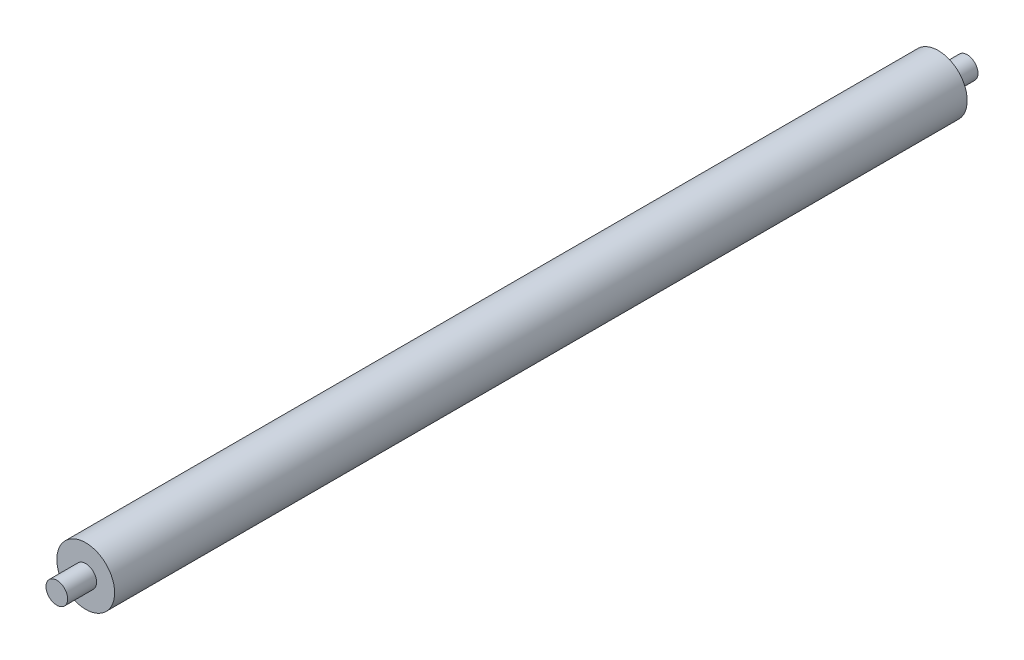
ISO-10303-21;
HEADER;
FILE_DESCRIPTION(('STEP AP214'),'2;1');
FILE_NAME('part.step','',(''),(''),'','','');
FILE_SCHEMA(('AUTOMOTIVE_DESIGN { 1 0 10303 214 1 1 1 1 }'));
ENDSEC;
DATA;
#1=APPLICATION_CONTEXT('core data for automotive mechanical design processes');
#2=APPLICATION_PROTOCOL_DEFINITION('international standard','automotive_design',2000,#1);
#3=PRODUCT_CONTEXT('',#1,'mechanical');
#4=PRODUCT('Part','Part','',(#3));
#5=PRODUCT_RELATED_PRODUCT_CATEGORY('part','',(#4));
#6=PRODUCT_DEFINITION_FORMATION('','',#4);
#7=PRODUCT_DEFINITION_CONTEXT('part definition',#1,'design');
#8=PRODUCT_DEFINITION('design','',#6,#7);
#9=PRODUCT_DEFINITION_SHAPE('','',#8);
#10=(LENGTH_UNIT() NAMED_UNIT(*) SI_UNIT(.MILLI.,.METRE.));
#11=(NAMED_UNIT(*) PLANE_ANGLE_UNIT() SI_UNIT($,.RADIAN.));
#12=(NAMED_UNIT(*) SI_UNIT($,.STERADIAN.) SOLID_ANGLE_UNIT());
#13=UNCERTAINTY_MEASURE_WITH_UNIT(LENGTH_MEASURE(1.E-05),#10,'distance_accuracy_value','');
#14=(GEOMETRIC_REPRESENTATION_CONTEXT(3) GLOBAL_UNCERTAINTY_ASSIGNED_CONTEXT((#13)) GLOBAL_UNIT_ASSIGNED_CONTEXT((#10,
#11,#12)) REPRESENTATION_CONTEXT('',''));
#15=CARTESIAN_POINT('',(0.,0.,0.));
#16=DIRECTION('',(0.,0.,1.));
#17=DIRECTION('',(1.,0.,0.));
#18=AXIS2_PLACEMENT_3D('',#15,#16,#17);
#19=CARTESIAN_POINT('',(0.,0.,118.));
#20=DIRECTION('',(0.,0.,-1.));
#21=DIRECTION('',(-1.,0.,0.));
#22=AXIS2_PLACEMENT_3D('',#19,#20,#21);
#23=CYLINDRICAL_SURFACE('',#22,4.);
#24=CARTESIAN_POINT('',(0.,0.,118.));
#25=DIRECTION('',(0.,0.,1.));
#26=DIRECTION('',(1.,0.,0.));
#27=AXIS2_PLACEMENT_3D('',#24,#25,#26);
#28=CIRCLE('',#27,4.);
#29=CARTESIAN_POINT('',(4.,0.,118.));
#30=VERTEX_POINT('',#29);
#31=EDGE_CURVE('E39',#30,#30,#28,.T.);
#32=ORIENTED_EDGE('',*,*,#31,.F.);
#33=EDGE_LOOP('',(#32));
#34=FACE_BOUND('',#33,.T.);
#35=CARTESIAN_POINT('',(0.,0.,0.));
#36=DIRECTION('',(0.,0.,1.));
#37=DIRECTION('',(1.,0.,0.));
#38=AXIS2_PLACEMENT_3D('',#35,#36,#37);
#39=CIRCLE('',#38,4.);
#40=CARTESIAN_POINT('',(4.,0.,0.));
#41=VERTEX_POINT('',#40);
#42=EDGE_CURVE('E43',#41,#41,#39,.T.);
#43=ORIENTED_EDGE('',*,*,#42,.T.);
#44=EDGE_LOOP('',(#43));
#45=FACE_BOUND('',#44,.T.);
#46=ADVANCED_FACE('F33',(#34,#45),#23,.T.);
#47=CARTESIAN_POINT('',(0.,0.,118.));
#48=DIRECTION('',(0.,0.,1.));
#49=DIRECTION('',(1.,0.,0.));
#50=AXIS2_PLACEMENT_3D('',#47,#48,#49);
#51=PLANE('',#50);
#52=CARTESIAN_POINT('',(0.,0.,118.));
#53=DIRECTION('',(0.,0.,1.));
#54=DIRECTION('',(1.,0.,0.));
#55=AXIS2_PLACEMENT_3D('',#52,#53,#54);
#56=CIRCLE('',#55,1.5);
#57=CARTESIAN_POINT('',(1.5,0.,118.));
#58=VERTEX_POINT('',#57);
#59=EDGE_CURVE('E53',#58,#58,#56,.T.);
#60=ORIENTED_EDGE('',*,*,#59,.F.);
#61=EDGE_LOOP('',(#60));
#62=FACE_BOUND('',#61,.T.);
#63=ORIENTED_EDGE('',*,*,#31,.T.);
#64=EDGE_LOOP('',(#63));
#65=FACE_BOUND('',#64,.T.);
#66=ADVANCED_FACE('F68',(#62,#65),#51,.T.);
#67=CARTESIAN_POINT('',(0.,0.,0.));
#68=DIRECTION('',(0.,0.,1.));
#69=DIRECTION('',(1.,0.,0.));
#70=AXIS2_PLACEMENT_3D('',#67,#68,#69);
#71=PLANE('',#70);
#72=CARTESIAN_POINT('',(0.,0.,0.));
#73=DIRECTION('',(0.,0.,1.));
#74=DIRECTION('',(1.,0.,0.));
#75=AXIS2_PLACEMENT_3D('',#72,#73,#74);
#76=CIRCLE('',#75,1.5);
#77=CARTESIAN_POINT('',(1.5,0.,0.));
#78=VERTEX_POINT('',#77);
#79=EDGE_CURVE('E10',#78,#78,#76,.F.);
#80=ORIENTED_EDGE('',*,*,#79,.F.);
#81=EDGE_LOOP('',(#80));
#82=FACE_BOUND('',#81,.T.);
#83=ORIENTED_EDGE('',*,*,#42,.F.);
#84=EDGE_LOOP('',(#83));
#85=FACE_BOUND('',#84,.T.);
#86=ADVANCED_FACE('F70',(#82,#85),#71,.F.);
#87=CARTESIAN_POINT('',(0.,0.,-4.));
#88=DIRECTION('',(0.,0.,1.));
#89=DIRECTION('',(1.,0.,0.));
#90=AXIS2_PLACEMENT_3D('',#87,#88,#89);
#91=CYLINDRICAL_SURFACE('',#90,1.5);
#92=CARTESIAN_POINT('',(0.,0.,-4.));
#93=DIRECTION('',(0.,0.,-1.));
#94=DIRECTION('',(-1.,0.,0.));
#95=AXIS2_PLACEMENT_3D('',#92,#93,#94);
#96=CIRCLE('',#95,1.5);
#97=CARTESIAN_POINT('',(-1.5,0.,-4.));
#98=VERTEX_POINT('',#97);
#99=EDGE_CURVE('E48',#98,#98,#96,.T.);
#100=ORIENTED_EDGE('',*,*,#99,.F.);
#101=EDGE_LOOP('',(#100));
#102=FACE_BOUND('',#101,.T.);
#103=ORIENTED_EDGE('',*,*,#79,.T.);
#104=EDGE_LOOP('',(#103));
#105=FACE_BOUND('',#104,.T.);
#106=ADVANCED_FACE('F76',(#102,#105),#91,.T.);
#107=CARTESIAN_POINT('',(0.,0.,-4.));
#108=DIRECTION('',(0.,0.,-1.));
#109=DIRECTION('',(-1.,0.,0.));
#110=AXIS2_PLACEMENT_3D('',#107,#108,#109);
#111=PLANE('',#110);
#112=ORIENTED_EDGE('',*,*,#99,.T.);
#113=EDGE_LOOP('',(#112));
#114=FACE_BOUND('',#113,.T.);
#115=ADVANCED_FACE('F64',(#114),#111,.T.);
#116=CARTESIAN_POINT('',(0.,0.,122.));
#117=DIRECTION('',(0.,0.,-1.));
#118=DIRECTION('',(-1.,0.,0.));
#119=AXIS2_PLACEMENT_3D('',#116,#117,#118);
#120=CYLINDRICAL_SURFACE('',#119,1.5);
#121=CARTESIAN_POINT('',(0.,0.,122.));
#122=DIRECTION('',(0.,0.,1.));
#123=DIRECTION('',(1.,0.,0.));
#124=AXIS2_PLACEMENT_3D('',#121,#122,#123);
#125=CIRCLE('',#124,1.5);
#126=CARTESIAN_POINT('',(1.5,0.,122.));
#127=VERTEX_POINT('',#126);
#128=EDGE_CURVE('E52',#127,#127,#125,.T.);
#129=ORIENTED_EDGE('',*,*,#128,.F.);
#130=EDGE_LOOP('',(#129));
#131=FACE_BOUND('',#130,.T.);
#132=ORIENTED_EDGE('',*,*,#59,.T.);
#133=EDGE_LOOP('',(#132));
#134=FACE_BOUND('',#133,.T.);
#135=ADVANCED_FACE('F61',(#131,#134),#120,.T.);
#136=CARTESIAN_POINT('',(0.,0.,122.));
#137=DIRECTION('',(0.,0.,1.));
#138=DIRECTION('',(1.,0.,0.));
#139=AXIS2_PLACEMENT_3D('',#136,#137,#138);
#140=PLANE('',#139);
#141=ORIENTED_EDGE('',*,*,#128,.T.);
#142=EDGE_LOOP('',(#141));
#143=FACE_BOUND('',#142,.T.);
#144=ADVANCED_FACE('F59',(#143),#140,.T.);
#145=CLOSED_SHELL('',(#46,#66,#86,#106,#115,#135,#144));
#146=MANIFOLD_SOLID_BREP('B2',#145);
#147=ADVANCED_BREP_SHAPE_REPRESENTATION('',(#18,#146),#14);
#148=SHAPE_DEFINITION_REPRESENTATION(#9,#147);
ENDSEC;
END-ISO-10303-21;
